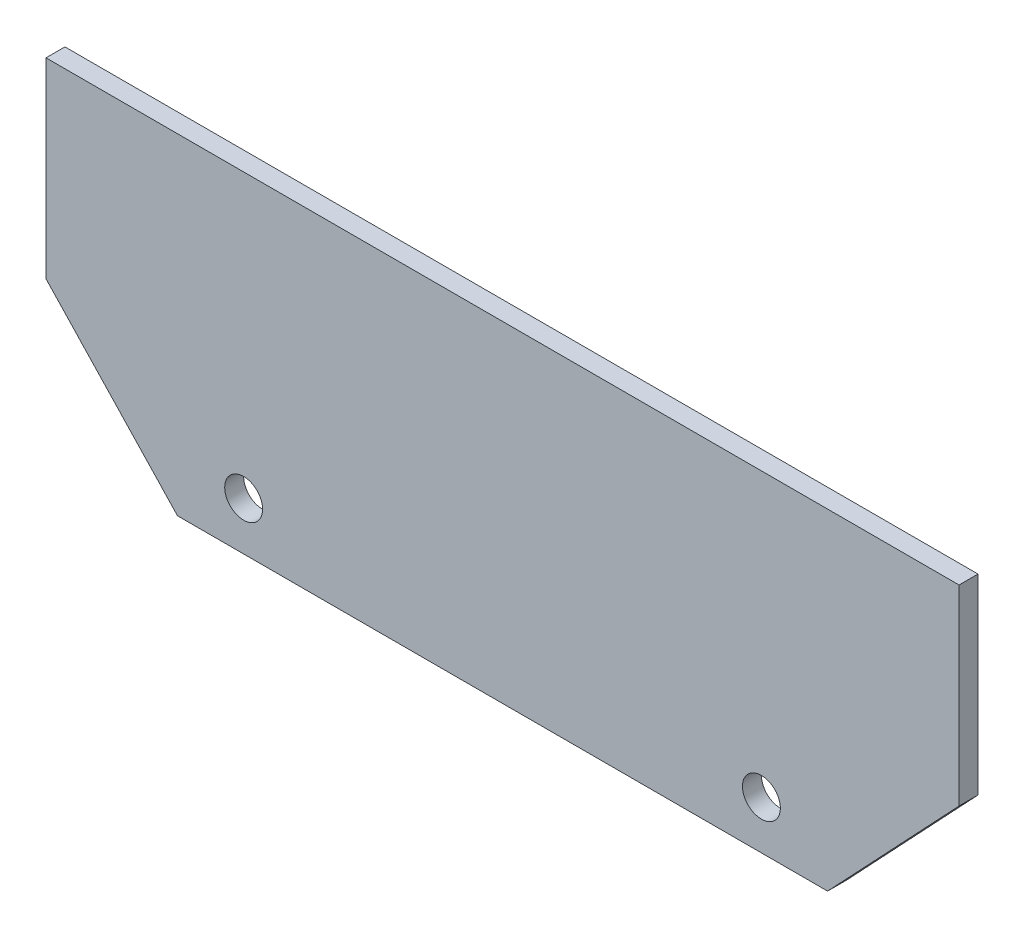
ISO-10303-21;
HEADER;
FILE_DESCRIPTION(('STEP AP214'),'2;1');
FILE_NAME('part.step','',(''),(''),'','','');
FILE_SCHEMA(('AUTOMOTIVE_DESIGN { 1 0 10303 214 1 1 1 1 }'));
ENDSEC;
DATA;
#1=APPLICATION_CONTEXT('core data for automotive mechanical design processes');
#2=APPLICATION_PROTOCOL_DEFINITION('international standard','automotive_design',2000,#1);
#3=PRODUCT_CONTEXT('',#1,'mechanical');
#4=PRODUCT('Part','Part','',(#3));
#5=PRODUCT_RELATED_PRODUCT_CATEGORY('part','',(#4));
#6=PRODUCT_DEFINITION_FORMATION('','',#4);
#7=PRODUCT_DEFINITION_CONTEXT('part definition',#1,'design');
#8=PRODUCT_DEFINITION('design','',#6,#7);
#9=PRODUCT_DEFINITION_SHAPE('','',#8);
#10=(LENGTH_UNIT() NAMED_UNIT(*) SI_UNIT(.MILLI.,.METRE.));
#11=(NAMED_UNIT(*) PLANE_ANGLE_UNIT() SI_UNIT($,.RADIAN.));
#12=(NAMED_UNIT(*) SI_UNIT($,.STERADIAN.) SOLID_ANGLE_UNIT());
#13=UNCERTAINTY_MEASURE_WITH_UNIT(LENGTH_MEASURE(1.E-05),#10,'distance_accuracy_value','');
#14=(GEOMETRIC_REPRESENTATION_CONTEXT(3) GLOBAL_UNCERTAINTY_ASSIGNED_CONTEXT((#13)) GLOBAL_UNIT_ASSIGNED_CONTEXT((#10,
#11,#12)) REPRESENTATION_CONTEXT('',''));
#15=CARTESIAN_POINT('',(0.,0.,0.));
#16=DIRECTION('',(0.,0.,1.));
#17=DIRECTION('',(1.,0.,0.));
#18=AXIS2_PLACEMENT_3D('',#15,#16,#17);
#19=CARTESIAN_POINT('',(72.3,11.044064583,1.5));
#20=DIRECTION('',(-1.,0.,0.));
#21=DIRECTION('',(0.,0.,1.));
#22=AXIS2_PLACEMENT_3D('',#19,#20,#21);
#23=PLANE('',#22);
#24=DIRECTION('',(0.,1.,0.));
#25=VECTOR('',#24,1.);
#26=CARTESIAN_POINT('',(72.3,11.044064583,0.));
#27=LINE('',#26,#25);
#28=CARTESIAN_POINT('',(72.3,11.044064583,0.));
#29=VERTEX_POINT('',#28);
#30=CARTESIAN_POINT('',(72.3,26.2,0.));
#31=VERTEX_POINT('',#30);
#32=EDGE_CURVE('E127',#29,#31,#27,.T.);
#33=ORIENTED_EDGE('',*,*,#32,.T.);
#34=DIRECTION('',(0.,0.,-1.));
#35=VECTOR('',#34,1.);
#36=CARTESIAN_POINT('',(72.3,26.2,1.5));
#37=LINE('',#36,#35);
#38=CARTESIAN_POINT('',(72.3,26.2,1.5));
#39=VERTEX_POINT('',#38);
#40=EDGE_CURVE('E11',#39,#31,#37,.T.);
#41=ORIENTED_EDGE('',*,*,#40,.F.);
#42=DIRECTION('',(0.,1.,0.));
#43=VECTOR('',#42,1.);
#44=CARTESIAN_POINT('',(72.3,11.044064583,1.5));
#45=LINE('',#44,#43);
#46=CARTESIAN_POINT('',(72.3,11.044064583,1.5));
#47=VERTEX_POINT('',#46);
#48=EDGE_CURVE('E144',#47,#39,#45,.T.);
#49=ORIENTED_EDGE('',*,*,#48,.F.);
#50=DIRECTION('',(0.,0.,-1.));
#51=VECTOR('',#50,1.);
#52=CARTESIAN_POINT('',(72.3,11.044064583,1.5));
#53=LINE('',#52,#51);
#54=EDGE_CURVE('E123',#47,#29,#53,.T.);
#55=ORIENTED_EDGE('',*,*,#54,.T.);
#56=EDGE_LOOP('',(#33,#41,#49,#55));
#57=FACE_BOUND('',#56,.T.);
#58=ADVANCED_FACE('F38',(#57),#23,.F.);
#59=CARTESIAN_POINT('',(0.,26.2,1.5));
#60=DIRECTION('',(0.,-1.,0.));
#61=DIRECTION('',(0.,0.,-1.));
#62=AXIS2_PLACEMENT_3D('',#59,#60,#61);
#63=PLANE('',#62);
#64=DIRECTION('',(-1.,0.,0.));
#65=VECTOR('',#64,1.);
#66=CARTESIAN_POINT('',(0.,26.2,0.));
#67=LINE('',#66,#65);
#68=CARTESIAN_POINT('',(0.,26.2,0.));
#69=VERTEX_POINT('',#68);
#70=EDGE_CURVE('E131',#31,#69,#67,.T.);
#71=ORIENTED_EDGE('',*,*,#70,.T.);
#72=DIRECTION('',(0.,0.,-1.));
#73=VECTOR('',#72,1.);
#74=CARTESIAN_POINT('',(0.,26.2,1.5));
#75=LINE('',#74,#73);
#76=CARTESIAN_POINT('',(0.,26.2,1.5));
#77=VERTEX_POINT('',#76);
#78=EDGE_CURVE('E47',#77,#69,#75,.T.);
#79=ORIENTED_EDGE('',*,*,#78,.F.);
#80=DIRECTION('',(-1.,0.,0.));
#81=VECTOR('',#80,1.);
#82=CARTESIAN_POINT('',(0.,26.2,1.5));
#83=LINE('',#82,#81);
#84=EDGE_CURVE('E92',#39,#77,#83,.T.);
#85=ORIENTED_EDGE('',*,*,#84,.F.);
#86=ORIENTED_EDGE('',*,*,#40,.T.);
#87=EDGE_LOOP('',(#71,#79,#85,#86));
#88=FACE_BOUND('',#87,.T.);
#89=ADVANCED_FACE('F174',(#88),#63,.F.);
#90=CARTESIAN_POINT('',(0.,11.044064583,1.5));
#91=DIRECTION('',(1.,0.,0.));
#92=DIRECTION('',(0.,0.,-1.));
#93=AXIS2_PLACEMENT_3D('',#90,#91,#92);
#94=PLANE('',#93);
#95=DIRECTION('',(0.,-1.,0.));
#96=VECTOR('',#95,1.);
#97=CARTESIAN_POINT('',(0.,11.044064583,0.));
#98=LINE('',#97,#96);
#99=CARTESIAN_POINT('',(0.,11.044064583,0.));
#100=VERTEX_POINT('',#99);
#101=EDGE_CURVE('E135',#69,#100,#98,.T.);
#102=ORIENTED_EDGE('',*,*,#101,.T.);
#103=DIRECTION('',(0.,0.,-1.));
#104=VECTOR('',#103,1.);
#105=CARTESIAN_POINT('',(0.,11.044064583,1.5));
#106=LINE('',#105,#104);
#107=CARTESIAN_POINT('',(0.,11.044064583,1.5));
#108=VERTEX_POINT('',#107);
#109=EDGE_CURVE('E116',#108,#100,#106,.T.);
#110=ORIENTED_EDGE('',*,*,#109,.F.);
#111=DIRECTION('',(0.,-1.,0.));
#112=VECTOR('',#111,1.);
#113=CARTESIAN_POINT('',(0.,11.044064583,1.5));
#114=LINE('',#113,#112);
#115=EDGE_CURVE('E105',#77,#108,#114,.T.);
#116=ORIENTED_EDGE('',*,*,#115,.F.);
#117=ORIENTED_EDGE('',*,*,#78,.T.);
#118=EDGE_LOOP('',(#102,#110,#116,#117));
#119=FACE_BOUND('',#118,.T.);
#120=ADVANCED_FACE('F154',(#119),#94,.F.);
#121=CARTESIAN_POINT('',(10.41,0.,1.5));
#122=DIRECTION('',(0.727687245769022,0.685909084606039,0.));
#123=DIRECTION('',(-0.685909084606039,0.727687245769022,0.));
#124=AXIS2_PLACEMENT_3D('',#121,#122,#123);
#125=PLANE('',#124);
#126=DIRECTION('',(0.685909084606039,-0.727687245769022,0.));
#127=VECTOR('',#126,1.);
#128=CARTESIAN_POINT('',(10.41,0.,0.));
#129=LINE('',#128,#127);
#130=CARTESIAN_POINT('',(10.41,0.,0.));
#131=VERTEX_POINT('',#130);
#132=EDGE_CURVE('E114',#100,#131,#129,.T.);
#133=ORIENTED_EDGE('',*,*,#132,.T.);
#134=DIRECTION('',(0.,0.,-1.));
#135=VECTOR('',#134,1.);
#136=CARTESIAN_POINT('',(10.41,0.,1.5));
#137=LINE('',#136,#135);
#138=CARTESIAN_POINT('',(10.41,0.,1.5));
#139=VERTEX_POINT('',#138);
#140=EDGE_CURVE('E111',#139,#131,#137,.T.);
#141=ORIENTED_EDGE('',*,*,#140,.F.);
#142=DIRECTION('',(0.685909084606039,-0.727687245769022,0.));
#143=VECTOR('',#142,1.);
#144=CARTESIAN_POINT('',(10.41,0.,1.5));
#145=LINE('',#144,#143);
#146=EDGE_CURVE('E99',#108,#139,#145,.T.);
#147=ORIENTED_EDGE('',*,*,#146,.F.);
#148=ORIENTED_EDGE('',*,*,#109,.T.);
#149=EDGE_LOOP('',(#133,#141,#147,#148));
#150=FACE_BOUND('',#149,.T.);
#151=ADVANCED_FACE('F112',(#150),#125,.F.);
#152=CARTESIAN_POINT('',(10.41,0.,1.5));
#153=DIRECTION('',(0.,1.,0.));
#154=DIRECTION('',(0.,0.,1.));
#155=AXIS2_PLACEMENT_3D('',#152,#153,#154);
#156=PLANE('',#155);
#157=DIRECTION('',(1.,0.,0.));
#158=VECTOR('',#157,1.);
#159=CARTESIAN_POINT('',(10.41,0.,0.));
#160=LINE('',#159,#158);
#161=CARTESIAN_POINT('',(61.89,0.,0.));
#162=VERTEX_POINT('',#161);
#163=EDGE_CURVE('E78',#131,#162,#160,.T.);
#164=ORIENTED_EDGE('',*,*,#163,.T.);
#165=DIRECTION('',(0.,0.,-1.));
#166=VECTOR('',#165,1.);
#167=CARTESIAN_POINT('',(61.89,0.,1.5));
#168=LINE('',#167,#166);
#169=CARTESIAN_POINT('',(61.89,0.,1.5));
#170=VERTEX_POINT('',#169);
#171=EDGE_CURVE('E117',#170,#162,#168,.T.);
#172=ORIENTED_EDGE('',*,*,#171,.F.);
#173=DIRECTION('',(1.,0.,0.));
#174=VECTOR('',#173,1.);
#175=CARTESIAN_POINT('',(10.41,0.,1.5));
#176=LINE('',#175,#174);
#177=EDGE_CURVE('E103',#139,#170,#176,.T.);
#178=ORIENTED_EDGE('',*,*,#177,.F.);
#179=ORIENTED_EDGE('',*,*,#140,.T.);
#180=EDGE_LOOP('',(#164,#172,#178,#179));
#181=FACE_BOUND('',#180,.T.);
#182=ADVANCED_FACE('F119',(#181),#156,.F.);
#183=CARTESIAN_POINT('',(61.89,0.,1.5));
#184=DIRECTION('',(-0.727687245769022,0.685909084606039,0.));
#185=DIRECTION('',(-0.685909084606039,-0.727687245769022,0.));
#186=AXIS2_PLACEMENT_3D('',#183,#184,#185);
#187=PLANE('',#186);
#188=DIRECTION('',(0.685909084606039,0.727687245769022,0.));
#189=VECTOR('',#188,1.);
#190=CARTESIAN_POINT('',(61.89,0.,0.));
#191=LINE('',#190,#189);
#192=EDGE_CURVE('E84',#162,#29,#191,.T.);
#193=ORIENTED_EDGE('',*,*,#192,.T.);
#194=ORIENTED_EDGE('',*,*,#54,.F.);
#195=DIRECTION('',(0.685909084606039,0.727687245769022,0.));
#196=VECTOR('',#195,1.);
#197=CARTESIAN_POINT('',(61.89,0.,1.5));
#198=LINE('',#197,#196);
#199=EDGE_CURVE('E55',#170,#47,#198,.T.);
#200=ORIENTED_EDGE('',*,*,#199,.F.);
#201=ORIENTED_EDGE('',*,*,#171,.T.);
#202=EDGE_LOOP('',(#193,#194,#200,#201));
#203=FACE_BOUND('',#202,.T.);
#204=ADVANCED_FACE('F161',(#203),#187,.F.);
#205=CARTESIAN_POINT('',(0.,0.,1.5));
#206=DIRECTION('',(0.,0.,-1.));
#207=DIRECTION('',(-1.,0.,0.));
#208=AXIS2_PLACEMENT_3D('',#205,#206,#207);
#209=PLANE('',#208);
#210=CARTESIAN_POINT('',(56.65,3.81578440477419,1.5));
#211=DIRECTION('',(0.,0.,-1.));
#212=DIRECTION('',(-1.,0.,0.));
#213=AXIS2_PLACEMENT_3D('',#210,#211,#212);
#214=CIRCLE('',#213,1.5);
#215=CARTESIAN_POINT('',(55.15,3.81578440477419,1.5));
#216=VERTEX_POINT('',#215);
#217=EDGE_CURVE('E132',#216,#216,#214,.T.);
#218=ORIENTED_EDGE('',*,*,#217,.T.);
#219=EDGE_LOOP('',(#218));
#220=FACE_BOUND('',#219,.T.);
#221=CARTESIAN_POINT('',(15.65,3.81578440477419,1.5));
#222=DIRECTION('',(0.,0.,-1.));
#223=DIRECTION('',(-1.,0.,0.));
#224=AXIS2_PLACEMENT_3D('',#221,#222,#223);
#225=CIRCLE('',#224,1.5);
#226=CARTESIAN_POINT('',(14.15,3.81578440477419,1.5));
#227=VERTEX_POINT('',#226);
#228=EDGE_CURVE('E236',#227,#227,#225,.T.);
#229=ORIENTED_EDGE('',*,*,#228,.T.);
#230=EDGE_LOOP('',(#229));
#231=FACE_BOUND('',#230,.T.);
#232=ORIENTED_EDGE('',*,*,#48,.T.);
#233=ORIENTED_EDGE('',*,*,#84,.T.);
#234=ORIENTED_EDGE('',*,*,#115,.T.);
#235=ORIENTED_EDGE('',*,*,#146,.T.);
#236=ORIENTED_EDGE('',*,*,#177,.T.);
#237=ORIENTED_EDGE('',*,*,#199,.T.);
#238=EDGE_LOOP('',(#232,#233,#234,#235,#236,#237));
#239=FACE_BOUND('',#238,.T.);
#240=ADVANCED_FACE('F101',(#220,#231,#239),#209,.F.);
#241=CARTESIAN_POINT('',(0.,0.,0.));
#242=DIRECTION('',(0.,0.,-1.));
#243=DIRECTION('',(-1.,0.,0.));
#244=AXIS2_PLACEMENT_3D('',#241,#242,#243);
#245=PLANE('',#244);
#246=CARTESIAN_POINT('',(56.65,3.81578440477419,0.));
#247=DIRECTION('',(0.,0.,-1.));
#248=DIRECTION('',(-1.,0.,0.));
#249=AXIS2_PLACEMENT_3D('',#246,#247,#248);
#250=CIRCLE('',#249,1.5);
#251=CARTESIAN_POINT('',(55.15,3.81578440477419,0.));
#252=VERTEX_POINT('',#251);
#253=EDGE_CURVE('E234',#252,#252,#250,.T.);
#254=ORIENTED_EDGE('',*,*,#253,.F.);
#255=EDGE_LOOP('',(#254));
#256=FACE_BOUND('',#255,.T.);
#257=CARTESIAN_POINT('',(15.65,3.81578440477419,0.));
#258=DIRECTION('',(0.,0.,-1.));
#259=DIRECTION('',(-1.,0.,0.));
#260=AXIS2_PLACEMENT_3D('',#257,#258,#259);
#261=CIRCLE('',#260,1.5);
#262=CARTESIAN_POINT('',(14.15,3.81578440477419,0.));
#263=VERTEX_POINT('',#262);
#264=EDGE_CURVE('E242',#263,#263,#261,.T.);
#265=ORIENTED_EDGE('',*,*,#264,.F.);
#266=EDGE_LOOP('',(#265));
#267=FACE_BOUND('',#266,.T.);
#268=ORIENTED_EDGE('',*,*,#32,.F.);
#269=ORIENTED_EDGE('',*,*,#192,.F.);
#270=ORIENTED_EDGE('',*,*,#163,.F.);
#271=ORIENTED_EDGE('',*,*,#132,.F.);
#272=ORIENTED_EDGE('',*,*,#101,.F.);
#273=ORIENTED_EDGE('',*,*,#70,.F.);
#274=EDGE_LOOP('',(#268,#269,#270,#271,#272,#273));
#275=FACE_BOUND('',#274,.T.);
#276=ADVANCED_FACE('F157',(#256,#267,#275),#245,.T.);
#277=CARTESIAN_POINT('',(15.65,3.81578440477419,1.5));
#278=DIRECTION('',(0.,0.,-1.));
#279=DIRECTION('',(-1.,0.,0.));
#280=AXIS2_PLACEMENT_3D('',#277,#278,#279);
#281=CYLINDRICAL_SURFACE('',#280,1.5);
#282=ORIENTED_EDGE('',*,*,#228,.F.);
#283=EDGE_LOOP('',(#282));
#284=FACE_BOUND('',#283,.T.);
#285=ORIENTED_EDGE('',*,*,#264,.T.);
#286=EDGE_LOOP('',(#285));
#287=FACE_BOUND('',#286,.T.);
#288=ADVANCED_FACE('F207',(#284,#287),#281,.F.);
#289=CARTESIAN_POINT('',(56.65,3.81578440477419,1.5));
#290=DIRECTION('',(0.,0.,-1.));
#291=DIRECTION('',(-1.,0.,0.));
#292=AXIS2_PLACEMENT_3D('',#289,#290,#291);
#293=CYLINDRICAL_SURFACE('',#292,1.5);
#294=ORIENTED_EDGE('',*,*,#217,.F.);
#295=EDGE_LOOP('',(#294));
#296=FACE_BOUND('',#295,.T.);
#297=ORIENTED_EDGE('',*,*,#253,.T.);
#298=EDGE_LOOP('',(#297));
#299=FACE_BOUND('',#298,.T.);
#300=ADVANCED_FACE('F215',(#296,#299),#293,.F.);
#301=CLOSED_SHELL('',(#58,#89,#120,#151,#182,#204,#240,#276,#288,#300));
#302=MANIFOLD_SOLID_BREP('B2',#301);
#303=ADVANCED_BREP_SHAPE_REPRESENTATION('',(#18,#302),#14);
#304=SHAPE_DEFINITION_REPRESENTATION(#9,#303);
ENDSEC;
END-ISO-10303-21;
